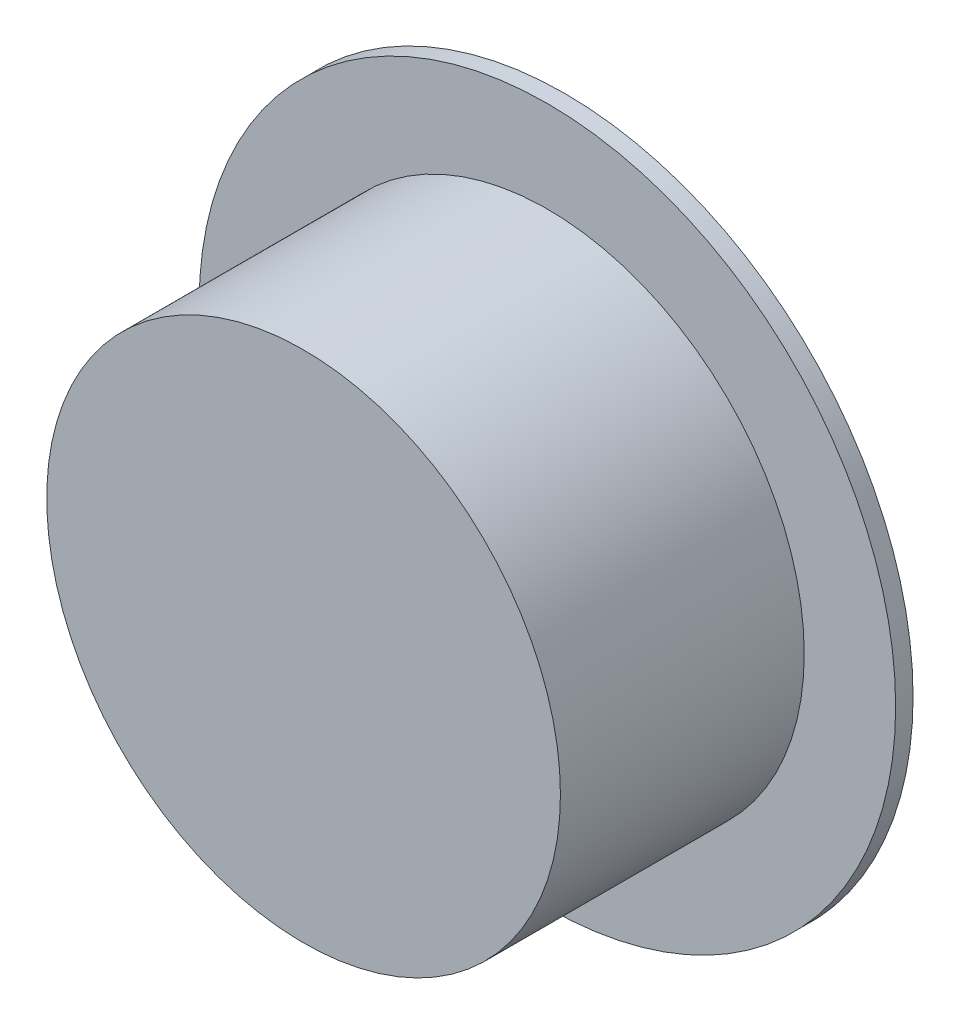
ISO-10303-21;
HEADER;
FILE_DESCRIPTION(('STEP AP214'),'2;1');
FILE_NAME('part.step','',(''),(''),'','','');
FILE_SCHEMA(('AUTOMOTIVE_DESIGN { 1 0 10303 214 1 1 1 1 }'));
ENDSEC;
DATA;
#1=APPLICATION_CONTEXT('core data for automotive mechanical design processes');
#2=APPLICATION_PROTOCOL_DEFINITION('international standard','automotive_design',2000,#1);
#3=PRODUCT_CONTEXT('',#1,'mechanical');
#4=PRODUCT('Part','Part','',(#3));
#5=PRODUCT_RELATED_PRODUCT_CATEGORY('part','',(#4));
#6=PRODUCT_DEFINITION_FORMATION('','',#4);
#7=PRODUCT_DEFINITION_CONTEXT('part definition',#1,'design');
#8=PRODUCT_DEFINITION('design','',#6,#7);
#9=PRODUCT_DEFINITION_SHAPE('','',#8);
#10=(LENGTH_UNIT() NAMED_UNIT(*) SI_UNIT(.MILLI.,.METRE.));
#11=(NAMED_UNIT(*) PLANE_ANGLE_UNIT() SI_UNIT($,.RADIAN.));
#12=(NAMED_UNIT(*) SI_UNIT($,.STERADIAN.) SOLID_ANGLE_UNIT());
#13=UNCERTAINTY_MEASURE_WITH_UNIT(LENGTH_MEASURE(1.E-05),#10,'distance_accuracy_value','');
#14=(GEOMETRIC_REPRESENTATION_CONTEXT(3) GLOBAL_UNCERTAINTY_ASSIGNED_CONTEXT((#13)) GLOBAL_UNIT_ASSIGNED_CONTEXT((#10,
#11,#12)) REPRESENTATION_CONTEXT('',''));
#15=CARTESIAN_POINT('',(0.,0.,0.));
#16=DIRECTION('',(0.,0.,1.));
#17=DIRECTION('',(1.,0.,0.));
#18=AXIS2_PLACEMENT_3D('',#15,#16,#17);
#19=CARTESIAN_POINT('',(0.,0.,7.5));
#20=DIRECTION('',(0.,0.,-1.));
#21=DIRECTION('',(-1.,0.,0.));
#22=AXIS2_PLACEMENT_3D('',#19,#20,#21);
#23=CYLINDRICAL_SURFACE('',#22,14.75);
#24=CARTESIAN_POINT('',(0.,0.,-6.5));
#25=DIRECTION('',(0.,0.,1.));
#26=DIRECTION('',(1.,0.,0.));
#27=AXIS2_PLACEMENT_3D('',#24,#25,#26);
#28=CIRCLE('',#27,14.75);
#29=CARTESIAN_POINT('',(14.75,0.,-6.5));
#30=VERTEX_POINT('',#29);
#31=EDGE_CURVE('E35',#30,#30,#28,.T.);
#32=ORIENTED_EDGE('',*,*,#31,.T.);
#33=EDGE_LOOP('',(#32));
#34=FACE_BOUND('',#33,.T.);
#35=CARTESIAN_POINT('',(0.,0.,7.5));
#36=DIRECTION('',(0.,0.,1.));
#37=DIRECTION('',(1.,0.,0.));
#38=AXIS2_PLACEMENT_3D('',#35,#36,#37);
#39=CIRCLE('',#38,14.75);
#40=CARTESIAN_POINT('',(14.75,0.,7.5));
#41=VERTEX_POINT('',#40);
#42=EDGE_CURVE('E10',#41,#41,#39,.T.);
#43=ORIENTED_EDGE('',*,*,#42,.F.);
#44=EDGE_LOOP('',(#43));
#45=FACE_BOUND('',#44,.T.);
#46=ADVANCED_FACE('F32',(#34,#45),#23,.T.);
#47=CARTESIAN_POINT('',(0.,0.,7.5));
#48=DIRECTION('',(0.,0.,1.));
#49=DIRECTION('',(1.,0.,0.));
#50=AXIS2_PLACEMENT_3D('',#47,#48,#49);
#51=PLANE('',#50);
#52=ORIENTED_EDGE('',*,*,#42,.T.);
#53=EDGE_LOOP('',(#52));
#54=FACE_BOUND('',#53,.T.);
#55=ADVANCED_FACE('F72',(#54),#51,.T.);
#56=CARTESIAN_POINT('',(0.,0.,-6.5));
#57=DIRECTION('',(0.,0.,-1.));
#58=DIRECTION('',(-1.,0.,0.));
#59=AXIS2_PLACEMENT_3D('',#56,#57,#58);
#60=CYLINDRICAL_SURFACE('',#59,20.);
#61=CARTESIAN_POINT('',(0.,0.,-6.5));
#62=DIRECTION('',(0.,0.,1.));
#63=DIRECTION('',(1.,0.,0.));
#64=AXIS2_PLACEMENT_3D('',#61,#62,#63);
#65=CIRCLE('',#64,20.);
#66=CARTESIAN_POINT('',(20.,0.,-6.5));
#67=VERTEX_POINT('',#66);
#68=EDGE_CURVE('E42',#67,#67,#65,.T.);
#69=ORIENTED_EDGE('',*,*,#68,.F.);
#70=EDGE_LOOP('',(#69));
#71=FACE_BOUND('',#70,.T.);
#72=CARTESIAN_POINT('',(0.,0.,-7.5));
#73=DIRECTION('',(0.,0.,1.));
#74=DIRECTION('',(1.,0.,0.));
#75=AXIS2_PLACEMENT_3D('',#72,#73,#74);
#76=CIRCLE('',#75,20.);
#77=CARTESIAN_POINT('',(20.,0.,-7.5));
#78=VERTEX_POINT('',#77);
#79=EDGE_CURVE('E44',#78,#78,#76,.T.);
#80=ORIENTED_EDGE('',*,*,#79,.T.);
#81=EDGE_LOOP('',(#80));
#82=FACE_BOUND('',#81,.T.);
#83=ADVANCED_FACE('F70',(#71,#82),#60,.T.);
#84=CARTESIAN_POINT('',(0.,0.,-6.5));
#85=DIRECTION('',(0.,0.,1.));
#86=DIRECTION('',(1.,0.,0.));
#87=AXIS2_PLACEMENT_3D('',#84,#85,#86);
#88=PLANE('',#87);
#89=ORIENTED_EDGE('',*,*,#31,.F.);
#90=EDGE_LOOP('',(#89));
#91=FACE_BOUND('',#90,.T.);
#92=ORIENTED_EDGE('',*,*,#68,.T.);
#93=EDGE_LOOP('',(#92));
#94=FACE_BOUND('',#93,.T.);
#95=ADVANCED_FACE('F67',(#91,#94),#88,.T.);
#96=CARTESIAN_POINT('',(0.,0.,-7.5));
#97=DIRECTION('',(0.,0.,1.));
#98=DIRECTION('',(1.,0.,0.));
#99=AXIS2_PLACEMENT_3D('',#96,#97,#98);
#100=PLANE('',#99);
#101=CARTESIAN_POINT('',(0.,0.,-7.5));
#102=DIRECTION('',(0.,0.,-1.));
#103=DIRECTION('',(-1.,0.,0.));
#104=AXIS2_PLACEMENT_3D('',#101,#102,#103);
#105=CIRCLE('',#104,12.5);
#106=CARTESIAN_POINT('',(-12.5,0.,-7.5));
#107=VERTEX_POINT('',#106);
#108=EDGE_CURVE('E50',#107,#107,#105,.T.);
#109=ORIENTED_EDGE('',*,*,#108,.F.);
#110=EDGE_LOOP('',(#109));
#111=FACE_BOUND('',#110,.T.);
#112=ORIENTED_EDGE('',*,*,#79,.F.);
#113=EDGE_LOOP('',(#112));
#114=FACE_BOUND('',#113,.T.);
#115=ADVANCED_FACE('F61',(#111,#114),#100,.F.);
#116=CARTESIAN_POINT('',(0.,0.,2.5));
#117=DIRECTION('',(0.,0.,-1.));
#118=DIRECTION('',(-1.,0.,0.));
#119=AXIS2_PLACEMENT_3D('',#116,#117,#118);
#120=CYLINDRICAL_SURFACE('',#119,12.5);
#121=CARTESIAN_POINT('',(0.,0.,2.5));
#122=DIRECTION('',(0.,0.,-1.));
#123=DIRECTION('',(-1.,0.,0.));
#124=AXIS2_PLACEMENT_3D('',#121,#122,#123);
#125=CIRCLE('',#124,12.5);
#126=CARTESIAN_POINT('',(-12.5,0.,2.5));
#127=VERTEX_POINT('',#126);
#128=EDGE_CURVE('E47',#127,#127,#125,.T.);
#129=ORIENTED_EDGE('',*,*,#128,.F.);
#130=EDGE_LOOP('',(#129));
#131=FACE_BOUND('',#130,.T.);
#132=ORIENTED_EDGE('',*,*,#108,.T.);
#133=EDGE_LOOP('',(#132));
#134=FACE_BOUND('',#133,.T.);
#135=ADVANCED_FACE('F58',(#131,#134),#120,.F.);
#136=CARTESIAN_POINT('',(0.,0.,2.5));
#137=DIRECTION('',(0.,0.,-1.));
#138=DIRECTION('',(-1.,0.,0.));
#139=AXIS2_PLACEMENT_3D('',#136,#137,#138);
#140=PLANE('',#139);
#141=ORIENTED_EDGE('',*,*,#128,.T.);
#142=EDGE_LOOP('',(#141));
#143=FACE_BOUND('',#142,.T.);
#144=ADVANCED_FACE('F56',(#143),#140,.T.);
#145=CLOSED_SHELL('',(#46,#55,#83,#95,#115,#135,#144));
#146=MANIFOLD_SOLID_BREP('B2',#145);
#147=ADVANCED_BREP_SHAPE_REPRESENTATION('',(#18,#146),#14);
#148=SHAPE_DEFINITION_REPRESENTATION(#9,#147);
ENDSEC;
END-ISO-10303-21;
